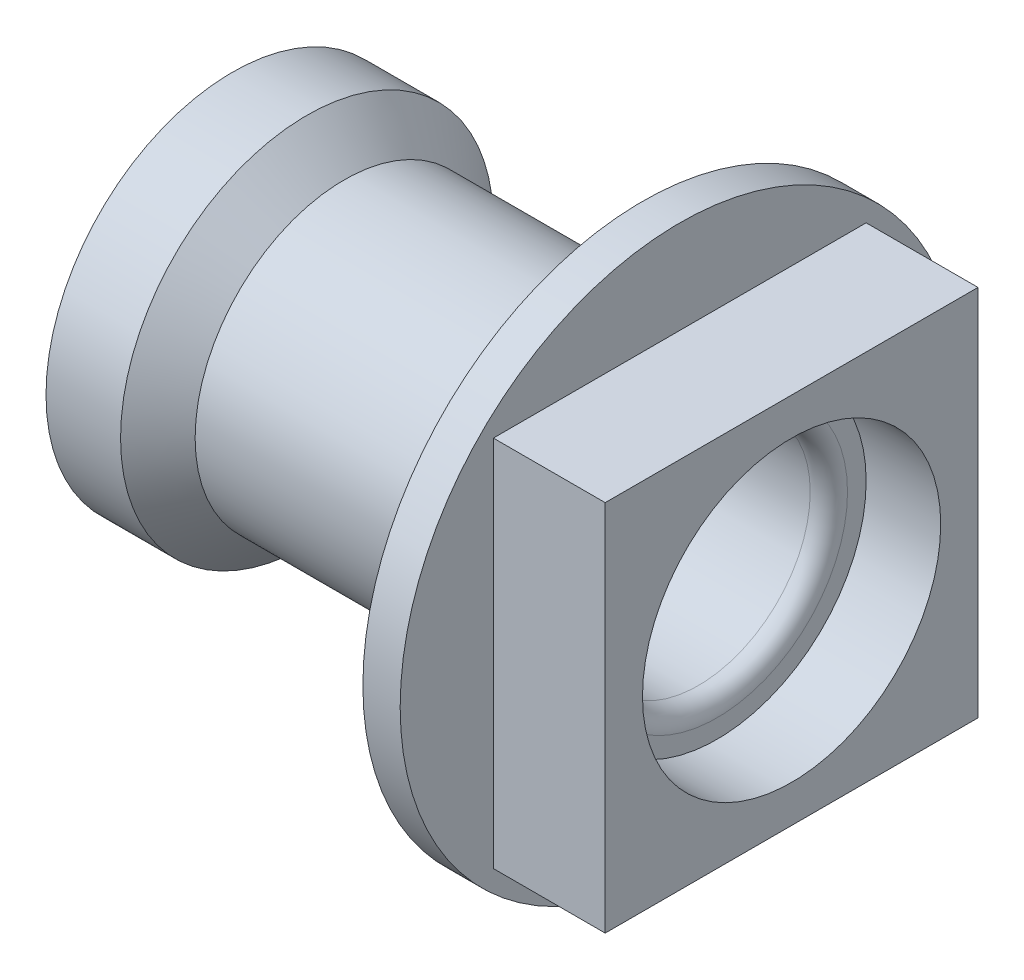
ISO-10303-21;
HEADER;
FILE_DESCRIPTION(('STEP AP214'),'2;1');
FILE_NAME('part.step','',(''),(''),'','','');
FILE_SCHEMA(('AUTOMOTIVE_DESIGN { 1 0 10303 214 1 1 1 1 }'));
ENDSEC;
DATA;
#1=APPLICATION_CONTEXT('core data for automotive mechanical design processes');
#2=APPLICATION_PROTOCOL_DEFINITION('international standard','automotive_design',2000,#1);
#3=PRODUCT_CONTEXT('',#1,'mechanical');
#4=PRODUCT('Part','Part','',(#3));
#5=PRODUCT_RELATED_PRODUCT_CATEGORY('part','',(#4));
#6=PRODUCT_DEFINITION_FORMATION('','',#4);
#7=PRODUCT_DEFINITION_CONTEXT('part definition',#1,'design');
#8=PRODUCT_DEFINITION('design','',#6,#7);
#9=PRODUCT_DEFINITION_SHAPE('','',#8);
#10=(LENGTH_UNIT() NAMED_UNIT(*) SI_UNIT(.MILLI.,.METRE.));
#11=(NAMED_UNIT(*) PLANE_ANGLE_UNIT() SI_UNIT($,.RADIAN.));
#12=(NAMED_UNIT(*) SI_UNIT($,.STERADIAN.) SOLID_ANGLE_UNIT());
#13=UNCERTAINTY_MEASURE_WITH_UNIT(LENGTH_MEASURE(1.E-05),#10,'distance_accuracy_value','');
#14=(GEOMETRIC_REPRESENTATION_CONTEXT(3) GLOBAL_UNCERTAINTY_ASSIGNED_CONTEXT((#13)) GLOBAL_UNIT_ASSIGNED_CONTEXT((#10,
#11,#12)) REPRESENTATION_CONTEXT('',''));
#15=CARTESIAN_POINT('',(0.,0.,0.));
#16=DIRECTION('',(0.,0.,1.));
#17=DIRECTION('',(1.,0.,0.));
#18=AXIS2_PLACEMENT_3D('',#15,#16,#17);
#19=CARTESIAN_POINT('',(120.,50.,0.));
#20=DIRECTION('',(-1.,0.,0.));
#21=DIRECTION('',(0.,0.,1.));
#22=AXIS2_PLACEMENT_3D('',#19,#20,#21);
#23=PLANE('',#22);
#24=CARTESIAN_POINT('',(120.,0.,0.));
#25=DIRECTION('',(-1.,0.,0.));
#26=DIRECTION('',(0.,0.,1.));
#27=AXIS2_PLACEMENT_3D('',#24,#25,#26);
#28=CIRCLE('',#27,75.);
#29=CARTESIAN_POINT('',(120.,0.,75.));
#30=VERTEX_POINT('',#29);
#31=EDGE_CURVE('E188',#30,#30,#28,.T.);
#32=ORIENTED_EDGE('',*,*,#31,.F.);
#33=EDGE_LOOP('',(#32));
#34=FACE_BOUND('',#33,.T.);
#35=DIRECTION('',(0.,0.,-1.));
#36=VECTOR('',#35,1.);
#37=CARTESIAN_POINT('',(120.,50.,0.));
#38=LINE('',#37,#36);
#39=CARTESIAN_POINT('',(120.,50.,50.));
#40=VERTEX_POINT('',#39);
#41=CARTESIAN_POINT('',(120.,50.,-50.));
#42=VERTEX_POINT('',#41);
#43=EDGE_CURVE('E117',#40,#42,#38,.T.);
#44=ORIENTED_EDGE('',*,*,#43,.T.);
#45=DIRECTION('',(0.,1.,0.));
#46=VECTOR('',#45,1.);
#47=CARTESIAN_POINT('',(120.,0.,-50.));
#48=LINE('',#47,#46);
#49=CARTESIAN_POINT('',(120.,-50.,-50.));
#50=VERTEX_POINT('',#49);
#51=EDGE_CURVE('E119',#50,#42,#48,.T.);
#52=ORIENTED_EDGE('',*,*,#51,.F.);
#53=DIRECTION('',(0.,0.,-1.));
#54=VECTOR('',#53,1.);
#55=CARTESIAN_POINT('',(120.,-50.,0.));
#56=LINE('',#55,#54);
#57=CARTESIAN_POINT('',(120.,-50.,50.));
#58=VERTEX_POINT('',#57);
#59=EDGE_CURVE('E151',#58,#50,#56,.T.);
#60=ORIENTED_EDGE('',*,*,#59,.F.);
#61=DIRECTION('',(0.,1.,0.));
#62=VECTOR('',#61,1.);
#63=CARTESIAN_POINT('',(120.,0.,50.));
#64=LINE('',#63,#62);
#65=EDGE_CURVE('E93',#58,#40,#64,.T.);
#66=ORIENTED_EDGE('',*,*,#65,.T.);
#67=EDGE_LOOP('',(#44,#52,#60,#66));
#68=FACE_BOUND('',#67,.T.);
#69=ADVANCED_FACE('F77',(#34,#68),#23,.F.);
#70=CARTESIAN_POINT('',(0.,50.,0.));
#71=DIRECTION('',(1.,0.,0.));
#72=DIRECTION('',(0.,0.,-1.));
#73=AXIS2_PLACEMENT_3D('',#70,#71,#72);
#74=PLANE('',#73);
#75=CARTESIAN_POINT('',(0.,0.,0.));
#76=DIRECTION('',(-1.,0.,0.));
#77=DIRECTION('',(0.,0.,1.));
#78=AXIS2_PLACEMENT_3D('',#75,#76,#77);
#79=CIRCLE('',#78,40.);
#80=CARTESIAN_POINT('',(0.,0.,40.));
#81=VERTEX_POINT('',#80);
#82=EDGE_CURVE('E12',#81,#81,#79,.T.);
#83=ORIENTED_EDGE('',*,*,#82,.F.);
#84=EDGE_LOOP('',(#83));
#85=FACE_BOUND('',#84,.T.);
#86=CARTESIAN_POINT('',(0.,0.,0.));
#87=DIRECTION('',(-1.,0.,0.));
#88=DIRECTION('',(0.,0.,1.));
#89=AXIS2_PLACEMENT_3D('',#86,#87,#88);
#90=CIRCLE('',#89,50.);
#91=CARTESIAN_POINT('',(0.,0.,50.));
#92=VERTEX_POINT('',#91);
#93=EDGE_CURVE('E122',#92,#92,#90,.T.);
#94=ORIENTED_EDGE('',*,*,#93,.T.);
#95=EDGE_LOOP('',(#94));
#96=FACE_BOUND('',#95,.T.);
#97=ADVANCED_FACE('F79',(#85,#96),#74,.F.);
#98=CARTESIAN_POINT('',(0.,0.,0.));
#99=DIRECTION('',(-1.,0.,0.));
#100=DIRECTION('',(0.,0.,1.));
#101=AXIS2_PLACEMENT_3D('',#98,#99,#100);
#102=CONICAL_SURFACE('',#101,40.,0.785398163397448);
#103=CARTESIAN_POINT('',(10.,0.,0.));
#104=DIRECTION('',(-1.,0.,0.));
#105=DIRECTION('',(0.,0.,1.));
#106=AXIS2_PLACEMENT_3D('',#103,#104,#105);
#107=CIRCLE('',#106,30.);
#108=CARTESIAN_POINT('',(10.,0.,30.));
#109=VERTEX_POINT('',#108);
#110=EDGE_CURVE('E86',#109,#109,#107,.T.);
#111=ORIENTED_EDGE('',*,*,#110,.F.);
#112=EDGE_LOOP('',(#111));
#113=FACE_BOUND('',#112,.T.);
#114=ORIENTED_EDGE('',*,*,#82,.T.);
#115=EDGE_LOOP('',(#114));
#116=FACE_BOUND('',#115,.T.);
#117=ADVANCED_FACE('F213',(#113,#116),#102,.F.);
#118=CARTESIAN_POINT('',(0.,0.,0.));
#119=DIRECTION('',(-1.,0.,0.));
#120=DIRECTION('',(0.,0.,1.));
#121=AXIS2_PLACEMENT_3D('',#118,#119,#120);
#122=CYLINDRICAL_SURFACE('',#121,30.);
#123=CARTESIAN_POINT('',(125.,0.,0.));
#124=DIRECTION('',(-1.,0.,0.));
#125=DIRECTION('',(0.,0.,1.));
#126=AXIS2_PLACEMENT_3D('',#123,#124,#125);
#127=CIRCLE('',#126,30.);
#128=CARTESIAN_POINT('',(125.,0.,30.));
#129=VERTEX_POINT('',#128);
#130=EDGE_CURVE('E204',#129,#129,#127,.T.);
#131=ORIENTED_EDGE('',*,*,#130,.F.);
#132=EDGE_LOOP('',(#131));
#133=FACE_BOUND('',#132,.T.);
#134=ORIENTED_EDGE('',*,*,#110,.T.);
#135=EDGE_LOOP('',(#134));
#136=FACE_BOUND('',#135,.T.);
#137=ADVANCED_FACE('F211',(#133,#136),#122,.F.);
#138=CARTESIAN_POINT('',(125.,0.,0.));
#139=DIRECTION('',(-1.,0.,0.));
#140=DIRECTION('',(0.,0.,1.));
#141=AXIS2_PLACEMENT_3D('',#138,#139,#140);
#142=TOROIDAL_SURFACE('',#141,35.,5.);
#143=CARTESIAN_POINT('',(130.,0.,0.));
#144=DIRECTION('',(-1.,0.,0.));
#145=DIRECTION('',(0.,0.,1.));
#146=AXIS2_PLACEMENT_3D('',#143,#144,#145);
#147=CIRCLE('',#146,35.);
#148=CARTESIAN_POINT('',(130.,0.,35.));
#149=VERTEX_POINT('',#148);
#150=EDGE_CURVE('E200',#149,#149,#147,.T.);
#151=ORIENTED_EDGE('',*,*,#150,.F.);
#152=EDGE_LOOP('',(#151));
#153=FACE_BOUND('',#152,.T.);
#154=ORIENTED_EDGE('',*,*,#130,.T.);
#155=EDGE_LOOP('',(#154));
#156=FACE_BOUND('',#155,.T.);
#157=ADVANCED_FACE('F274',(#153,#156),#142,.T.);
#158=CARTESIAN_POINT('',(130.,35.,0.));
#159=DIRECTION('',(-1.,0.,0.));
#160=DIRECTION('',(0.,0.,1.));
#161=AXIS2_PLACEMENT_3D('',#158,#159,#160);
#162=PLANE('',#161);
#163=CARTESIAN_POINT('',(130.,0.,0.));
#164=DIRECTION('',(-1.,0.,0.));
#165=DIRECTION('',(0.,0.,1.));
#166=AXIS2_PLACEMENT_3D('',#163,#164,#165);
#167=CIRCLE('',#166,40.);
#168=CARTESIAN_POINT('',(130.,0.,40.));
#169=VERTEX_POINT('',#168);
#170=EDGE_CURVE('E196',#169,#169,#167,.T.);
#171=ORIENTED_EDGE('',*,*,#170,.F.);
#172=EDGE_LOOP('',(#171));
#173=FACE_BOUND('',#172,.T.);
#174=ORIENTED_EDGE('',*,*,#150,.T.);
#175=EDGE_LOOP('',(#174));
#176=FACE_BOUND('',#175,.T.);
#177=ADVANCED_FACE('F270',(#173,#176),#162,.F.);
#178=CARTESIAN_POINT('',(0.,0.,0.));
#179=DIRECTION('',(-1.,0.,0.));
#180=DIRECTION('',(0.,0.,1.));
#181=AXIS2_PLACEMENT_3D('',#178,#179,#180);
#182=CYLINDRICAL_SURFACE('',#181,40.);
#183=CARTESIAN_POINT('',(150.,0.,0.));
#184=DIRECTION('',(-1.,0.,0.));
#185=DIRECTION('',(0.,0.,1.));
#186=AXIS2_PLACEMENT_3D('',#183,#184,#185);
#187=CIRCLE('',#186,40.);
#188=CARTESIAN_POINT('',(150.,0.,40.));
#189=VERTEX_POINT('',#188);
#190=EDGE_CURVE('E192',#189,#189,#187,.T.);
#191=ORIENTED_EDGE('',*,*,#190,.F.);
#192=EDGE_LOOP('',(#191));
#193=FACE_BOUND('',#192,.T.);
#194=ORIENTED_EDGE('',*,*,#170,.T.);
#195=EDGE_LOOP('',(#194));
#196=FACE_BOUND('',#195,.T.);
#197=ADVANCED_FACE('F266',(#193,#196),#182,.F.);
#198=CARTESIAN_POINT('',(150.,40.,0.));
#199=DIRECTION('',(-1.,0.,0.));
#200=DIRECTION('',(0.,0.,1.));
#201=AXIS2_PLACEMENT_3D('',#198,#199,#200);
#202=PLANE('',#201);
#203=DIRECTION('',(0.,1.,0.));
#204=VECTOR('',#203,1.);
#205=CARTESIAN_POINT('',(150.,0.,-50.));
#206=LINE('',#205,#204);
#207=CARTESIAN_POINT('',(150.,-50.,-50.));
#208=VERTEX_POINT('',#207);
#209=CARTESIAN_POINT('',(150.,50.,-50.));
#210=VERTEX_POINT('',#209);
#211=EDGE_CURVE('E133',#208,#210,#206,.T.);
#212=ORIENTED_EDGE('',*,*,#211,.T.);
#213=DIRECTION('',(0.,0.,-1.));
#214=VECTOR('',#213,1.);
#215=CARTESIAN_POINT('',(150.,50.,0.));
#216=LINE('',#215,#214);
#217=CARTESIAN_POINT('',(150.,50.,50.));
#218=VERTEX_POINT('',#217);
#219=EDGE_CURVE('E137',#218,#210,#216,.T.);
#220=ORIENTED_EDGE('',*,*,#219,.F.);
#221=DIRECTION('',(0.,1.,0.));
#222=VECTOR('',#221,1.);
#223=CARTESIAN_POINT('',(150.,0.,50.));
#224=LINE('',#223,#222);
#225=CARTESIAN_POINT('',(150.,-50.,50.));
#226=VERTEX_POINT('',#225);
#227=EDGE_CURVE('E156',#226,#218,#224,.T.);
#228=ORIENTED_EDGE('',*,*,#227,.F.);
#229=DIRECTION('',(0.,0.,-1.));
#230=VECTOR('',#229,1.);
#231=CARTESIAN_POINT('',(150.,-50.,0.));
#232=LINE('',#231,#230);
#233=EDGE_CURVE('E145',#226,#208,#232,.T.);
#234=ORIENTED_EDGE('',*,*,#233,.T.);
#235=EDGE_LOOP('',(#212,#220,#228,#234));
#236=FACE_BOUND('',#235,.T.);
#237=ORIENTED_EDGE('',*,*,#190,.T.);
#238=EDGE_LOOP('',(#237));
#239=FACE_BOUND('',#238,.T.);
#240=ADVANCED_FACE('F255',(#236,#239),#202,.F.);
#241=CARTESIAN_POINT('',(0.,0.,0.));
#242=DIRECTION('',(-1.,0.,0.));
#243=DIRECTION('',(0.,0.,1.));
#244=AXIS2_PLACEMENT_3D('',#241,#242,#243);
#245=CYLINDRICAL_SURFACE('',#244,75.);
#246=CARTESIAN_POINT('',(110.,0.,0.));
#247=DIRECTION('',(-1.,0.,0.));
#248=DIRECTION('',(0.,0.,1.));
#249=AXIS2_PLACEMENT_3D('',#246,#247,#248);
#250=CIRCLE('',#249,75.);
#251=CARTESIAN_POINT('',(110.,0.,75.));
#252=VERTEX_POINT('',#251);
#253=EDGE_CURVE('E184',#252,#252,#250,.T.);
#254=ORIENTED_EDGE('',*,*,#253,.F.);
#255=EDGE_LOOP('',(#254));
#256=FACE_BOUND('',#255,.T.);
#257=ORIENTED_EDGE('',*,*,#31,.T.);
#258=EDGE_LOOP('',(#257));
#259=FACE_BOUND('',#258,.T.);
#260=ADVANCED_FACE('F249',(#256,#259),#245,.T.);
#261=CARTESIAN_POINT('',(110.,75.,0.));
#262=DIRECTION('',(1.,0.,0.));
#263=DIRECTION('',(0.,0.,-1.));
#264=AXIS2_PLACEMENT_3D('',#261,#262,#263);
#265=PLANE('',#264);
#266=CARTESIAN_POINT('',(110.,0.,0.));
#267=DIRECTION('',(-1.,0.,0.));
#268=DIRECTION('',(0.,0.,1.));
#269=AXIS2_PLACEMENT_3D('',#266,#267,#268);
#270=CIRCLE('',#269,50.);
#271=CARTESIAN_POINT('',(110.,0.,50.));
#272=VERTEX_POINT('',#271);
#273=EDGE_CURVE('E180',#272,#272,#270,.T.);
#274=ORIENTED_EDGE('',*,*,#273,.F.);
#275=EDGE_LOOP('',(#274));
#276=FACE_BOUND('',#275,.T.);
#277=ORIENTED_EDGE('',*,*,#253,.T.);
#278=EDGE_LOOP('',(#277));
#279=FACE_BOUND('',#278,.T.);
#280=ADVANCED_FACE('F243',(#276,#279),#265,.F.);
#281=CARTESIAN_POINT('',(100.,0.,0.));
#282=DIRECTION('',(-1.,0.,0.));
#283=DIRECTION('',(0.,0.,1.));
#284=AXIS2_PLACEMENT_3D('',#281,#282,#283);
#285=TOROIDAL_SURFACE('',#284,50.,10.);
#286=CARTESIAN_POINT('',(100.,0.,0.));
#287=DIRECTION('',(-1.,0.,0.));
#288=DIRECTION('',(0.,0.,1.));
#289=AXIS2_PLACEMENT_3D('',#286,#287,#288);
#290=CIRCLE('',#289,40.);
#291=CARTESIAN_POINT('',(100.,0.,40.));
#292=VERTEX_POINT('',#291);
#293=EDGE_CURVE('E176',#292,#292,#290,.T.);
#294=ORIENTED_EDGE('',*,*,#293,.F.);
#295=EDGE_LOOP('',(#294));
#296=FACE_BOUND('',#295,.T.);
#297=ORIENTED_EDGE('',*,*,#273,.T.);
#298=EDGE_LOOP('',(#297));
#299=FACE_BOUND('',#298,.T.);
#300=ADVANCED_FACE('F237',(#296,#299),#285,.F.);
#301=CARTESIAN_POINT('',(0.,0.,0.));
#302=DIRECTION('',(-1.,0.,0.));
#303=DIRECTION('',(0.,0.,1.));
#304=AXIS2_PLACEMENT_3D('',#301,#302,#303);
#305=CYLINDRICAL_SURFACE('',#304,40.);
#306=CARTESIAN_POINT('',(30.,0.,0.));
#307=DIRECTION('',(-1.,0.,0.));
#308=DIRECTION('',(0.,0.,1.));
#309=AXIS2_PLACEMENT_3D('',#306,#307,#308);
#310=CIRCLE('',#309,40.);
#311=CARTESIAN_POINT('',(30.,0.,40.));
#312=VERTEX_POINT('',#311);
#313=EDGE_CURVE('E172',#312,#312,#310,.T.);
#314=ORIENTED_EDGE('',*,*,#313,.F.);
#315=EDGE_LOOP('',(#314));
#316=FACE_BOUND('',#315,.T.);
#317=ORIENTED_EDGE('',*,*,#293,.T.);
#318=EDGE_LOOP('',(#317));
#319=FACE_BOUND('',#318,.T.);
#320=ADVANCED_FACE('F231',(#316,#319),#305,.T.);
#321=CARTESIAN_POINT('',(30.,0.,0.));
#322=DIRECTION('',(-1.,0.,0.));
#323=DIRECTION('',(0.,0.,1.));
#324=AXIS2_PLACEMENT_3D('',#321,#322,#323);
#325=CONICAL_SURFACE('',#324,40.,0.785398163397448);
#326=CARTESIAN_POINT('',(20.,0.,0.));
#327=DIRECTION('',(-1.,0.,0.));
#328=DIRECTION('',(0.,0.,1.));
#329=AXIS2_PLACEMENT_3D('',#326,#327,#328);
#330=CIRCLE('',#329,50.);
#331=CARTESIAN_POINT('',(20.,0.,50.));
#332=VERTEX_POINT('',#331);
#333=EDGE_CURVE('E168',#332,#332,#330,.T.);
#334=ORIENTED_EDGE('',*,*,#333,.F.);
#335=EDGE_LOOP('',(#334));
#336=FACE_BOUND('',#335,.T.);
#337=ORIENTED_EDGE('',*,*,#313,.T.);
#338=EDGE_LOOP('',(#337));
#339=FACE_BOUND('',#338,.T.);
#340=ADVANCED_FACE('F225',(#336,#339),#325,.T.);
#341=CARTESIAN_POINT('',(0.,0.,0.));
#342=DIRECTION('',(-1.,0.,0.));
#343=DIRECTION('',(0.,0.,1.));
#344=AXIS2_PLACEMENT_3D('',#341,#342,#343);
#345=CYLINDRICAL_SURFACE('',#344,50.);
#346=ORIENTED_EDGE('',*,*,#93,.F.);
#347=EDGE_LOOP('',(#346));
#348=FACE_BOUND('',#347,.T.);
#349=ORIENTED_EDGE('',*,*,#333,.T.);
#350=EDGE_LOOP('',(#349));
#351=FACE_BOUND('',#350,.T.);
#352=ADVANCED_FACE('F222',(#348,#351),#345,.T.);
#353=CARTESIAN_POINT('',(49.2893218813452,50.,0.));
#354=DIRECTION('',(0.,-1.,0.));
#355=DIRECTION('',(0.,0.,-1.));
#356=AXIS2_PLACEMENT_3D('',#353,#354,#355);
#357=PLANE('',#356);
#358=ORIENTED_EDGE('',*,*,#43,.F.);
#359=DIRECTION('',(1.,0.,0.));
#360=VECTOR('',#359,1.);
#361=CARTESIAN_POINT('',(49.2893218813452,50.,50.));
#362=LINE('',#361,#360);
#363=EDGE_CURVE('E100',#40,#218,#362,.T.);
#364=ORIENTED_EDGE('',*,*,#363,.T.);
#365=ORIENTED_EDGE('',*,*,#219,.T.);
#366=DIRECTION('',(1.,0.,0.));
#367=VECTOR('',#366,1.);
#368=CARTESIAN_POINT('',(49.2893218813452,50.,-50.));
#369=LINE('',#368,#367);
#370=EDGE_CURVE('E129',#42,#210,#369,.T.);
#371=ORIENTED_EDGE('',*,*,#370,.F.);
#372=EDGE_LOOP('',(#358,#364,#365,#371));
#373=FACE_BOUND('',#372,.T.);
#374=ADVANCED_FACE('F135',(#373),#357,.F.);
#375=CARTESIAN_POINT('',(49.2893218813452,0.,50.));
#376=DIRECTION('',(0.,0.,-1.));
#377=DIRECTION('',(-1.,0.,0.));
#378=AXIS2_PLACEMENT_3D('',#375,#376,#377);
#379=PLANE('',#378);
#380=ORIENTED_EDGE('',*,*,#65,.F.);
#381=DIRECTION('',(1.,0.,0.));
#382=VECTOR('',#381,1.);
#383=CARTESIAN_POINT('',(49.2893218813452,-50.,50.));
#384=LINE('',#383,#382);
#385=EDGE_CURVE('E147',#58,#226,#384,.T.);
#386=ORIENTED_EDGE('',*,*,#385,.T.);
#387=ORIENTED_EDGE('',*,*,#227,.T.);
#388=ORIENTED_EDGE('',*,*,#363,.F.);
#389=EDGE_LOOP('',(#380,#386,#387,#388));
#390=FACE_BOUND('',#389,.T.);
#391=ADVANCED_FACE('F333',(#390),#379,.F.);
#392=CARTESIAN_POINT('',(49.2893218813452,-50.,0.));
#393=DIRECTION('',(0.,-1.,0.));
#394=DIRECTION('',(0.,0.,-1.));
#395=AXIS2_PLACEMENT_3D('',#392,#393,#394);
#396=PLANE('',#395);
#397=ORIENTED_EDGE('',*,*,#385,.F.);
#398=ORIENTED_EDGE('',*,*,#59,.T.);
#399=DIRECTION('',(1.,0.,0.));
#400=VECTOR('',#399,1.);
#401=CARTESIAN_POINT('',(49.2893218813452,-50.,-50.));
#402=LINE('',#401,#400);
#403=EDGE_CURVE('E131',#50,#208,#402,.T.);
#404=ORIENTED_EDGE('',*,*,#403,.T.);
#405=ORIENTED_EDGE('',*,*,#233,.F.);
#406=EDGE_LOOP('',(#397,#398,#404,#405));
#407=FACE_BOUND('',#406,.T.);
#408=ADVANCED_FACE('F340',(#407),#396,.T.);
#409=CARTESIAN_POINT('',(49.2893218813452,0.,-50.));
#410=DIRECTION('',(0.,0.,-1.));
#411=DIRECTION('',(-1.,0.,0.));
#412=AXIS2_PLACEMENT_3D('',#409,#410,#411);
#413=PLANE('',#412);
#414=ORIENTED_EDGE('',*,*,#403,.F.);
#415=ORIENTED_EDGE('',*,*,#51,.T.);
#416=ORIENTED_EDGE('',*,*,#370,.T.);
#417=ORIENTED_EDGE('',*,*,#211,.F.);
#418=EDGE_LOOP('',(#414,#415,#416,#417));
#419=FACE_BOUND('',#418,.T.);
#420=ADVANCED_FACE('F127',(#419),#413,.T.);
#421=CLOSED_SHELL('',(#69,#97,#117,#137,#157,#177,#197,#240,#260,#280,#300,#320,#340,#352,#374,
#391,#408,#420));
#422=MANIFOLD_SOLID_BREP('B2',#421);
#423=ADVANCED_BREP_SHAPE_REPRESENTATION('',(#18,#422),#14);
#424=SHAPE_DEFINITION_REPRESENTATION(#9,#423);
ENDSEC;
END-ISO-10303-21;
